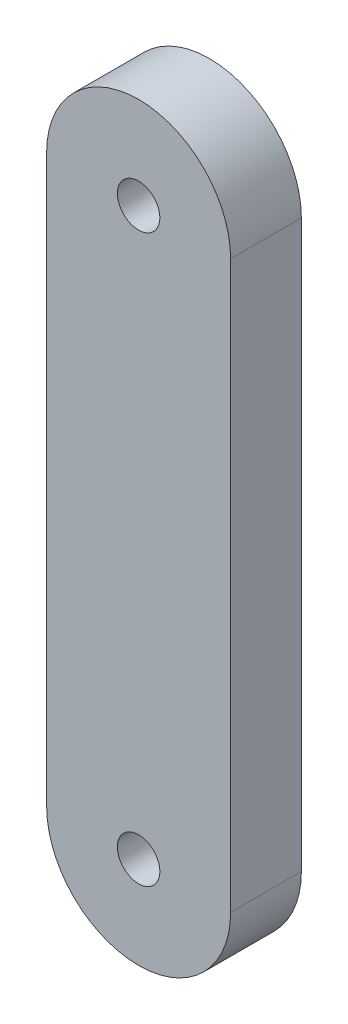
ISO-10303-21;
HEADER;
FILE_DESCRIPTION(('STEP AP214'),'2;1');
FILE_NAME('part.step','',(''),(''),'','','');
FILE_SCHEMA(('AUTOMOTIVE_DESIGN { 1 0 10303 214 1 1 1 1 }'));
ENDSEC;
DATA;
#1=APPLICATION_CONTEXT('core data for automotive mechanical design processes');
#2=APPLICATION_PROTOCOL_DEFINITION('international standard','automotive_design',2000,#1);
#3=PRODUCT_CONTEXT('',#1,'mechanical');
#4=PRODUCT('Part','Part','',(#3));
#5=PRODUCT_RELATED_PRODUCT_CATEGORY('part','',(#4));
#6=PRODUCT_DEFINITION_FORMATION('','',#4);
#7=PRODUCT_DEFINITION_CONTEXT('part definition',#1,'design');
#8=PRODUCT_DEFINITION('design','',#6,#7);
#9=PRODUCT_DEFINITION_SHAPE('','',#8);
#10=(LENGTH_UNIT() NAMED_UNIT(*) SI_UNIT(.MILLI.,.METRE.));
#11=(NAMED_UNIT(*) PLANE_ANGLE_UNIT() SI_UNIT($,.RADIAN.));
#12=(NAMED_UNIT(*) SI_UNIT($,.STERADIAN.) SOLID_ANGLE_UNIT());
#13=UNCERTAINTY_MEASURE_WITH_UNIT(LENGTH_MEASURE(1.E-05),#10,'distance_accuracy_value','');
#14=(GEOMETRIC_REPRESENTATION_CONTEXT(3) GLOBAL_UNCERTAINTY_ASSIGNED_CONTEXT((#13)) GLOBAL_UNIT_ASSIGNED_CONTEXT((#10,
#11,#12)) REPRESENTATION_CONTEXT('',''));
#15=CARTESIAN_POINT('',(0.,0.,0.));
#16=DIRECTION('',(0.,0.,1.));
#17=DIRECTION('',(1.,0.,0.));
#18=AXIS2_PLACEMENT_3D('',#15,#16,#17);
#19=CARTESIAN_POINT('',(0.,0.,2.5));
#20=DIRECTION('',(0.,0.,1.));
#21=DIRECTION('',(1.,0.,0.));
#22=AXIS2_PLACEMENT_3D('',#19,#20,#21);
#23=PLANE('',#22);
#24=CARTESIAN_POINT('',(0.,20.,2.5));
#25=DIRECTION('',(0.,0.,1.));
#26=DIRECTION('',(1.,0.,0.));
#27=AXIS2_PLACEMENT_3D('',#24,#25,#26);
#28=CIRCLE('',#27,0.75);
#29=CARTESIAN_POINT('',(0.750000000000001,20.,2.5));
#30=VERTEX_POINT('',#29);
#31=EDGE_CURVE('E106',#30,#30,#28,.T.);
#32=ORIENTED_EDGE('',*,*,#31,.F.);
#33=EDGE_LOOP('',(#32));
#34=FACE_BOUND('',#33,.T.);
#35=CARTESIAN_POINT('',(0.,0.,2.5));
#36=DIRECTION('',(0.,0.,1.));
#37=DIRECTION('',(1.,0.,0.));
#38=AXIS2_PLACEMENT_3D('',#35,#36,#37);
#39=CIRCLE('',#38,3.25);
#40=CARTESIAN_POINT('',(-3.25,0.,2.5));
#41=VERTEX_POINT('',#40);
#42=CARTESIAN_POINT('',(3.25,0.,2.5));
#43=VERTEX_POINT('',#42);
#44=EDGE_CURVE('E91',#41,#43,#39,.T.);
#45=ORIENTED_EDGE('',*,*,#44,.T.);
#46=DIRECTION('',(0.,1.,0.));
#47=VECTOR('',#46,1.);
#48=CARTESIAN_POINT('',(3.25,0.,2.5));
#49=LINE('',#48,#47);
#50=CARTESIAN_POINT('',(3.25,20.,2.5));
#51=VERTEX_POINT('',#50);
#52=EDGE_CURVE('E86',#43,#51,#49,.T.);
#53=ORIENTED_EDGE('',*,*,#52,.T.);
#54=CARTESIAN_POINT('',(0.,20.,2.5));
#55=DIRECTION('',(0.,0.,1.));
#56=DIRECTION('',(1.,0.,0.));
#57=AXIS2_PLACEMENT_3D('',#54,#55,#56);
#58=CIRCLE('',#57,3.25);
#59=CARTESIAN_POINT('',(-3.25,20.,2.5));
#60=VERTEX_POINT('',#59);
#61=EDGE_CURVE('E89',#51,#60,#58,.T.);
#62=ORIENTED_EDGE('',*,*,#61,.T.);
#63=DIRECTION('',(0.,-1.,0.));
#64=VECTOR('',#63,1.);
#65=CARTESIAN_POINT('',(-3.25,0.,2.5));
#66=LINE('',#65,#64);
#67=EDGE_CURVE('E56',#60,#41,#66,.T.);
#68=ORIENTED_EDGE('',*,*,#67,.T.);
#69=EDGE_LOOP('',(#45,#53,#62,#68));
#70=FACE_BOUND('',#69,.T.);
#71=CARTESIAN_POINT('',(0.,0.,2.5));
#72=DIRECTION('',(0.,0.,1.));
#73=DIRECTION('',(1.,0.,0.));
#74=AXIS2_PLACEMENT_3D('',#71,#72,#73);
#75=CIRCLE('',#74,0.75);
#76=CARTESIAN_POINT('',(0.75,0.,2.5));
#77=VERTEX_POINT('',#76);
#78=EDGE_CURVE('E121',#77,#77,#75,.T.);
#79=ORIENTED_EDGE('',*,*,#78,.F.);
#80=EDGE_LOOP('',(#79));
#81=FACE_BOUND('',#80,.T.);
#82=ADVANCED_FACE('F39',(#34,#70,#81),#23,.T.);
#83=CARTESIAN_POINT('',(0.,0.,0.));
#84=DIRECTION('',(0.,0.,1.));
#85=DIRECTION('',(1.,0.,0.));
#86=AXIS2_PLACEMENT_3D('',#83,#84,#85);
#87=PLANE('',#86);
#88=CARTESIAN_POINT('',(0.,0.,0.));
#89=DIRECTION('',(0.,0.,1.));
#90=DIRECTION('',(1.,0.,0.));
#91=AXIS2_PLACEMENT_3D('',#88,#89,#90);
#92=CIRCLE('',#91,3.25);
#93=CARTESIAN_POINT('',(-3.25,0.,0.));
#94=VERTEX_POINT('',#93);
#95=CARTESIAN_POINT('',(3.25,0.,0.));
#96=VERTEX_POINT('',#95);
#97=EDGE_CURVE('E103',#94,#96,#92,.T.);
#98=ORIENTED_EDGE('',*,*,#97,.F.);
#99=DIRECTION('',(0.,-1.,0.));
#100=VECTOR('',#99,1.);
#101=CARTESIAN_POINT('',(-3.25,0.,0.));
#102=LINE('',#101,#100);
#103=CARTESIAN_POINT('',(-3.25,20.,0.));
#104=VERTEX_POINT('',#103);
#105=EDGE_CURVE('E79',#104,#94,#102,.T.);
#106=ORIENTED_EDGE('',*,*,#105,.F.);
#107=CARTESIAN_POINT('',(0.,20.,0.));
#108=DIRECTION('',(0.,0.,1.));
#109=DIRECTION('',(1.,0.,0.));
#110=AXIS2_PLACEMENT_3D('',#107,#108,#109);
#111=CIRCLE('',#110,3.25);
#112=CARTESIAN_POINT('',(3.25,20.,0.));
#113=VERTEX_POINT('',#112);
#114=EDGE_CURVE('E73',#113,#104,#111,.T.);
#115=ORIENTED_EDGE('',*,*,#114,.F.);
#116=DIRECTION('',(0.,1.,0.));
#117=VECTOR('',#116,1.);
#118=CARTESIAN_POINT('',(3.25,0.,0.));
#119=LINE('',#118,#117);
#120=EDGE_CURVE('E95',#96,#113,#119,.T.);
#121=ORIENTED_EDGE('',*,*,#120,.F.);
#122=EDGE_LOOP('',(#98,#106,#115,#121));
#123=FACE_BOUND('',#122,.T.);
#124=CARTESIAN_POINT('',(0.,20.,0.));
#125=DIRECTION('',(0.,0.,1.));
#126=DIRECTION('',(1.,0.,0.));
#127=AXIS2_PLACEMENT_3D('',#124,#125,#126);
#128=CIRCLE('',#127,0.75);
#129=CARTESIAN_POINT('',(0.750000000000001,20.,0.));
#130=VERTEX_POINT('',#129);
#131=EDGE_CURVE('E118',#130,#130,#128,.T.);
#132=ORIENTED_EDGE('',*,*,#131,.T.);
#133=EDGE_LOOP('',(#132));
#134=FACE_BOUND('',#133,.T.);
#135=CARTESIAN_POINT('',(0.,0.,0.));
#136=DIRECTION('',(0.,0.,1.));
#137=DIRECTION('',(1.,0.,0.));
#138=AXIS2_PLACEMENT_3D('',#135,#136,#137);
#139=CIRCLE('',#138,0.75);
#140=CARTESIAN_POINT('',(0.75,0.,0.));
#141=VERTEX_POINT('',#140);
#142=EDGE_CURVE('E124',#141,#141,#139,.T.);
#143=ORIENTED_EDGE('',*,*,#142,.T.);
#144=EDGE_LOOP('',(#143));
#145=FACE_BOUND('',#144,.T.);
#146=ADVANCED_FACE('F114',(#123,#134,#145),#87,.F.);
#147=CARTESIAN_POINT('',(0.,0.,2.5));
#148=DIRECTION('',(0.,0.,-1.));
#149=DIRECTION('',(-1.,0.,0.));
#150=AXIS2_PLACEMENT_3D('',#147,#148,#149);
#151=CYLINDRICAL_SURFACE('',#150,3.25);
#152=ORIENTED_EDGE('',*,*,#97,.T.);
#153=DIRECTION('',(0.,0.,-1.));
#154=VECTOR('',#153,1.);
#155=CARTESIAN_POINT('',(3.25,0.,2.5));
#156=LINE('',#155,#154);
#157=EDGE_CURVE('E11',#43,#96,#156,.T.);
#158=ORIENTED_EDGE('',*,*,#157,.F.);
#159=ORIENTED_EDGE('',*,*,#44,.F.);
#160=DIRECTION('',(0.,0.,-1.));
#161=VECTOR('',#160,1.);
#162=CARTESIAN_POINT('',(-3.25,0.,2.5));
#163=LINE('',#162,#161);
#164=EDGE_CURVE('E99',#41,#94,#163,.T.);
#165=ORIENTED_EDGE('',*,*,#164,.T.);
#166=EDGE_LOOP('',(#152,#158,#159,#165));
#167=FACE_BOUND('',#166,.T.);
#168=ADVANCED_FACE('F41',(#167),#151,.T.);
#169=CARTESIAN_POINT('',(3.25,0.,2.5));
#170=DIRECTION('',(-1.,0.,0.));
#171=DIRECTION('',(0.,-1.,0.));
#172=AXIS2_PLACEMENT_3D('',#169,#170,#171);
#173=PLANE('',#172);
#174=ORIENTED_EDGE('',*,*,#120,.T.);
#175=DIRECTION('',(0.,0.,-1.));
#176=VECTOR('',#175,1.);
#177=CARTESIAN_POINT('',(3.25,20.,2.5));
#178=LINE('',#177,#176);
#179=EDGE_CURVE('E48',#51,#113,#178,.T.);
#180=ORIENTED_EDGE('',*,*,#179,.F.);
#181=ORIENTED_EDGE('',*,*,#52,.F.);
#182=ORIENTED_EDGE('',*,*,#157,.T.);
#183=EDGE_LOOP('',(#174,#180,#181,#182));
#184=FACE_BOUND('',#183,.T.);
#185=ADVANCED_FACE('F94',(#184),#173,.F.);
#186=CARTESIAN_POINT('',(0.,20.,2.5));
#187=DIRECTION('',(0.,0.,-1.));
#188=DIRECTION('',(-1.,0.,0.));
#189=AXIS2_PLACEMENT_3D('',#186,#187,#188);
#190=CYLINDRICAL_SURFACE('',#189,3.25);
#191=ORIENTED_EDGE('',*,*,#114,.T.);
#192=DIRECTION('',(0.,0.,-1.));
#193=VECTOR('',#192,1.);
#194=CARTESIAN_POINT('',(-3.25,20.,2.5));
#195=LINE('',#194,#193);
#196=EDGE_CURVE('E96',#60,#104,#195,.T.);
#197=ORIENTED_EDGE('',*,*,#196,.F.);
#198=ORIENTED_EDGE('',*,*,#61,.F.);
#199=ORIENTED_EDGE('',*,*,#179,.T.);
#200=EDGE_LOOP('',(#191,#197,#198,#199));
#201=FACE_BOUND('',#200,.T.);
#202=ADVANCED_FACE('F97',(#201),#190,.T.);
#203=CARTESIAN_POINT('',(-3.25,0.,2.5));
#204=DIRECTION('',(1.,0.,0.));
#205=DIRECTION('',(0.,0.,-1.));
#206=AXIS2_PLACEMENT_3D('',#203,#204,#205);
#207=PLANE('',#206);
#208=ORIENTED_EDGE('',*,*,#105,.T.);
#209=ORIENTED_EDGE('',*,*,#164,.F.);
#210=ORIENTED_EDGE('',*,*,#67,.F.);
#211=ORIENTED_EDGE('',*,*,#196,.T.);
#212=EDGE_LOOP('',(#208,#209,#210,#211));
#213=FACE_BOUND('',#212,.T.);
#214=ADVANCED_FACE('F111',(#213),#207,.F.);
#215=CARTESIAN_POINT('',(0.,20.,2.5));
#216=DIRECTION('',(0.,0.,-1.));
#217=DIRECTION('',(-1.,0.,0.));
#218=AXIS2_PLACEMENT_3D('',#215,#216,#217);
#219=CYLINDRICAL_SURFACE('',#218,0.75);
#220=ORIENTED_EDGE('',*,*,#31,.T.);
#221=EDGE_LOOP('',(#220));
#222=FACE_BOUND('',#221,.T.);
#223=ORIENTED_EDGE('',*,*,#131,.F.);
#224=EDGE_LOOP('',(#223));
#225=FACE_BOUND('',#224,.T.);
#226=ADVANCED_FACE('F141',(#222,#225),#219,.F.);
#227=CARTESIAN_POINT('',(0.,0.,2.5));
#228=DIRECTION('',(0.,0.,-1.));
#229=DIRECTION('',(-1.,0.,0.));
#230=AXIS2_PLACEMENT_3D('',#227,#228,#229);
#231=CYLINDRICAL_SURFACE('',#230,0.75);
#232=ORIENTED_EDGE('',*,*,#78,.T.);
#233=EDGE_LOOP('',(#232));
#234=FACE_BOUND('',#233,.T.);
#235=ORIENTED_EDGE('',*,*,#142,.F.);
#236=EDGE_LOOP('',(#235));
#237=FACE_BOUND('',#236,.T.);
#238=ADVANCED_FACE('F130',(#234,#237),#231,.F.);
#239=CLOSED_SHELL('',(#82,#146,#168,#185,#202,#214,#226,#238));
#240=MANIFOLD_SOLID_BREP('B2',#239);
#241=ADVANCED_BREP_SHAPE_REPRESENTATION('',(#18,#240),#14);
#242=SHAPE_DEFINITION_REPRESENTATION(#9,#241);
ENDSEC;
END-ISO-10303-21;
